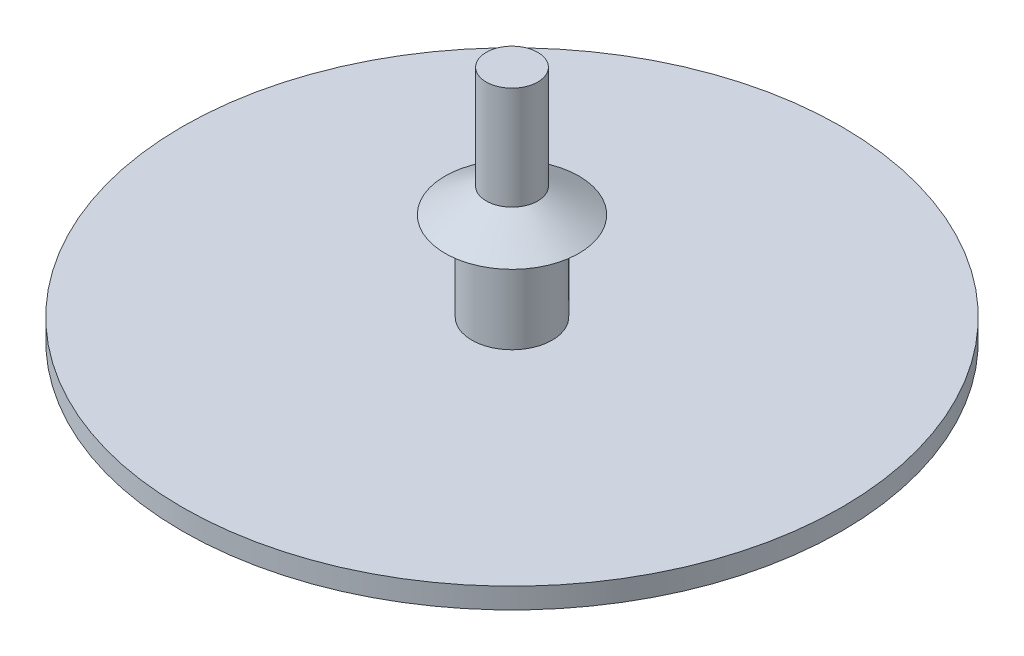
ISO-10303-21;
HEADER;
FILE_DESCRIPTION(('STEP AP214'),'2;1');
FILE_NAME('part.step','',(''),(''),'','','');
FILE_SCHEMA(('AUTOMOTIVE_DESIGN { 1 0 10303 214 1 1 1 1 }'));
ENDSEC;
DATA;
#1=APPLICATION_CONTEXT('core data for automotive mechanical design processes');
#2=APPLICATION_PROTOCOL_DEFINITION('international standard','automotive_design',2000,#1);
#3=PRODUCT_CONTEXT('',#1,'mechanical');
#4=PRODUCT('Part','Part','',(#3));
#5=PRODUCT_RELATED_PRODUCT_CATEGORY('part','',(#4));
#6=PRODUCT_DEFINITION_FORMATION('','',#4);
#7=PRODUCT_DEFINITION_CONTEXT('part definition',#1,'design');
#8=PRODUCT_DEFINITION('design','',#6,#7);
#9=PRODUCT_DEFINITION_SHAPE('','',#8);
#10=(LENGTH_UNIT() NAMED_UNIT(*) SI_UNIT(.MILLI.,.METRE.));
#11=(NAMED_UNIT(*) PLANE_ANGLE_UNIT() SI_UNIT($,.RADIAN.));
#12=(NAMED_UNIT(*) SI_UNIT($,.STERADIAN.) SOLID_ANGLE_UNIT());
#13=UNCERTAINTY_MEASURE_WITH_UNIT(LENGTH_MEASURE(1.E-05),#10,'distance_accuracy_value','');
#14=(GEOMETRIC_REPRESENTATION_CONTEXT(3) GLOBAL_UNCERTAINTY_ASSIGNED_CONTEXT((#13)) GLOBAL_UNIT_ASSIGNED_CONTEXT((#10,
#11,#12)) REPRESENTATION_CONTEXT('',''));
#15=CARTESIAN_POINT('',(0.,0.,0.));
#16=DIRECTION('',(0.,0.,1.));
#17=DIRECTION('',(1.,0.,0.));
#18=AXIS2_PLACEMENT_3D('',#15,#16,#17);
#19=CARTESIAN_POINT('',(1.95,0.5,0.));
#20=DIRECTION('',(0.,1.,0.));
#21=DIRECTION('',(0.,0.,1.));
#22=AXIS2_PLACEMENT_3D('',#19,#20,#21);
#23=PLANE('',#22);
#24=CARTESIAN_POINT('',(0.,0.5,0.));
#25=DIRECTION('',(0.,-1.,0.));
#26=DIRECTION('',(0.,0.,-1.));
#27=AXIS2_PLACEMENT_3D('',#24,#25,#26);
#28=CIRCLE('',#27,1.95);
#29=CARTESIAN_POINT('',(0.,0.5,-1.95));
#30=VERTEX_POINT('',#29);
#31=EDGE_CURVE('E10',#30,#30,#28,.T.);
#32=ORIENTED_EDGE('',*,*,#31,.T.);
#33=EDGE_LOOP('',(#32));
#34=FACE_BOUND('',#33,.T.);
#35=CARTESIAN_POINT('',(0.,0.5,0.));
#36=DIRECTION('',(0.,-1.,0.));
#37=DIRECTION('',(0.,0.,-1.));
#38=AXIS2_PLACEMENT_3D('',#35,#36,#37);
#39=CIRCLE('',#38,16.);
#40=CARTESIAN_POINT('',(0.,0.5,-16.));
#41=VERTEX_POINT('',#40);
#42=EDGE_CURVE('E68',#41,#41,#39,.T.);
#43=ORIENTED_EDGE('',*,*,#42,.F.);
#44=EDGE_LOOP('',(#43));
#45=FACE_BOUND('',#44,.T.);
#46=ADVANCED_FACE('F37',(#34,#45),#23,.T.);
#47=CARTESIAN_POINT('',(0.,0.,0.));
#48=DIRECTION('',(0.,-1.,0.));
#49=DIRECTION('',(0.,0.,-1.));
#50=AXIS2_PLACEMENT_3D('',#47,#48,#49);
#51=CYLINDRICAL_SURFACE('',#50,1.95);
#52=CARTESIAN_POINT('',(0.,4.8,0.));
#53=DIRECTION('',(0.,-1.,0.));
#54=DIRECTION('',(0.,0.,-1.));
#55=AXIS2_PLACEMENT_3D('',#52,#53,#54);
#56=CIRCLE('',#55,1.95);
#57=CARTESIAN_POINT('',(0.,4.8,-1.95));
#58=VERTEX_POINT('',#57);
#59=EDGE_CURVE('E44',#58,#58,#56,.T.);
#60=ORIENTED_EDGE('',*,*,#59,.T.);
#61=EDGE_LOOP('',(#60));
#62=FACE_BOUND('',#61,.T.);
#63=ORIENTED_EDGE('',*,*,#31,.F.);
#64=EDGE_LOOP('',(#63));
#65=FACE_BOUND('',#64,.T.);
#66=ADVANCED_FACE('F77',(#62,#65),#51,.T.);
#67=CARTESIAN_POINT('',(1.95,4.8,0.));
#68=DIRECTION('',(0.,-1.,0.));
#69=DIRECTION('',(0.,0.,-1.));
#70=AXIS2_PLACEMENT_3D('',#67,#68,#69);
#71=PLANE('',#70);
#72=CARTESIAN_POINT('',(0.,4.8,0.));
#73=DIRECTION('',(0.,-1.,0.));
#74=DIRECTION('',(0.,0.,-1.));
#75=AXIS2_PLACEMENT_3D('',#72,#73,#74);
#76=CIRCLE('',#75,3.25);
#77=CARTESIAN_POINT('',(0.,4.8,-3.25));
#78=VERTEX_POINT('',#77);
#79=EDGE_CURVE('E49',#78,#78,#76,.T.);
#80=ORIENTED_EDGE('',*,*,#79,.T.);
#81=EDGE_LOOP('',(#80));
#82=FACE_BOUND('',#81,.T.);
#83=ORIENTED_EDGE('',*,*,#59,.F.);
#84=EDGE_LOOP('',(#83));
#85=FACE_BOUND('',#84,.T.);
#86=ADVANCED_FACE('F81',(#82,#85),#71,.T.);
#87=CARTESIAN_POINT('',(0.,4.8,0.));
#88=DIRECTION('',(0.,-1.,0.));
#89=DIRECTION('',(0.,0.,-1.));
#90=AXIS2_PLACEMENT_3D('',#87,#88,#89);
#91=CONICAL_SURFACE('',#90,3.25,1.03037682652431);
#92=CARTESIAN_POINT('',(0.,6.,0.));
#93=DIRECTION('',(0.,-1.,0.));
#94=DIRECTION('',(0.,0.,-1.));
#95=AXIS2_PLACEMENT_3D('',#92,#93,#94);
#96=CIRCLE('',#95,1.25000000000001);
#97=CARTESIAN_POINT('',(0.,6.,-1.25000000000001));
#98=VERTEX_POINT('',#97);
#99=EDGE_CURVE('E54',#98,#98,#96,.T.);
#100=ORIENTED_EDGE('',*,*,#99,.T.);
#101=EDGE_LOOP('',(#100));
#102=FACE_BOUND('',#101,.T.);
#103=ORIENTED_EDGE('',*,*,#79,.F.);
#104=EDGE_LOOP('',(#103));
#105=FACE_BOUND('',#104,.T.);
#106=ADVANCED_FACE('F85',(#102,#105),#91,.T.);
#107=CARTESIAN_POINT('',(0.,0.,0.));
#108=DIRECTION('',(0.,-1.,0.));
#109=DIRECTION('',(0.,0.,-1.));
#110=AXIS2_PLACEMENT_3D('',#107,#108,#109);
#111=CYLINDRICAL_SURFACE('',#110,1.25000000000001);
#112=CARTESIAN_POINT('',(0.,11.,0.));
#113=DIRECTION('',(0.,-1.,0.));
#114=DIRECTION('',(0.,0.,-1.));
#115=AXIS2_PLACEMENT_3D('',#112,#113,#114);
#116=CIRCLE('',#115,1.25000000000001);
#117=CARTESIAN_POINT('',(0.,11.,-1.25000000000001));
#118=VERTEX_POINT('',#117);
#119=EDGE_CURVE('E60',#118,#118,#116,.T.);
#120=ORIENTED_EDGE('',*,*,#119,.T.);
#121=EDGE_LOOP('',(#120));
#122=FACE_BOUND('',#121,.T.);
#123=ORIENTED_EDGE('',*,*,#99,.F.);
#124=EDGE_LOOP('',(#123));
#125=FACE_BOUND('',#124,.T.);
#126=ADVANCED_FACE('F92',(#122,#125),#111,.T.);
#127=CARTESIAN_POINT('',(1.25000000000001,11.,0.));
#128=DIRECTION('',(0.,1.,0.));
#129=DIRECTION('',(0.,0.,1.));
#130=AXIS2_PLACEMENT_3D('',#127,#128,#129);
#131=PLANE('',#130);
#132=ORIENTED_EDGE('',*,*,#119,.F.);
#133=EDGE_LOOP('',(#132));
#134=FACE_BOUND('',#133,.T.);
#135=ADVANCED_FACE('F96',(#134),#131,.T.);
#136=CARTESIAN_POINT('',(0.,-0.5,0.));
#137=DIRECTION('',(0.,-1.,0.));
#138=DIRECTION('',(0.,0.,-1.));
#139=AXIS2_PLACEMENT_3D('',#136,#137,#138);
#140=PLANE('',#139);
#141=CARTESIAN_POINT('',(0.,-0.5,0.));
#142=DIRECTION('',(0.,-1.,0.));
#143=DIRECTION('',(0.,0.,-1.));
#144=AXIS2_PLACEMENT_3D('',#141,#142,#143);
#145=CIRCLE('',#144,16.);
#146=CARTESIAN_POINT('',(0.,-0.5,-16.));
#147=VERTEX_POINT('',#146);
#148=EDGE_CURVE('E64',#147,#147,#145,.T.);
#149=ORIENTED_EDGE('',*,*,#148,.T.);
#150=EDGE_LOOP('',(#149));
#151=FACE_BOUND('',#150,.T.);
#152=ADVANCED_FACE('F100',(#151),#140,.T.);
#153=CARTESIAN_POINT('',(0.,0.,0.));
#154=DIRECTION('',(0.,-1.,0.));
#155=DIRECTION('',(0.,0.,-1.));
#156=AXIS2_PLACEMENT_3D('',#153,#154,#155);
#157=CYLINDRICAL_SURFACE('',#156,16.);
#158=ORIENTED_EDGE('',*,*,#42,.T.);
#159=EDGE_LOOP('',(#158));
#160=FACE_BOUND('',#159,.T.);
#161=ORIENTED_EDGE('',*,*,#148,.F.);
#162=EDGE_LOOP('',(#161));
#163=FACE_BOUND('',#162,.T.);
#164=ADVANCED_FACE('F73',(#160,#163),#157,.T.);
#165=CLOSED_SHELL('',(#46,#66,#86,#106,#126,#135,#152,#164));
#166=MANIFOLD_SOLID_BREP('B2',#165);
#167=ADVANCED_BREP_SHAPE_REPRESENTATION('',(#18,#166),#14);
#168=SHAPE_DEFINITION_REPRESENTATION(#9,#167);
ENDSEC;
END-ISO-10303-21;
